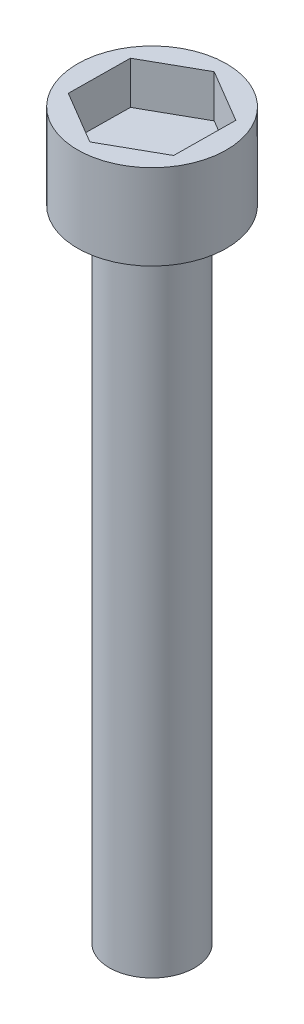
ISO-10303-21;
HEADER;
FILE_DESCRIPTION(('STEP AP214'),'2;1');
FILE_NAME('part.step','',(''),(''),'','','');
FILE_SCHEMA(('AUTOMOTIVE_DESIGN { 1 0 10303 214 1 1 1 1 }'));
ENDSEC;
DATA;
#1=APPLICATION_CONTEXT('core data for automotive mechanical design processes');
#2=APPLICATION_PROTOCOL_DEFINITION('international standard','automotive_design',2000,#1);
#3=PRODUCT_CONTEXT('',#1,'mechanical');
#4=PRODUCT('Part','Part','',(#3));
#5=PRODUCT_RELATED_PRODUCT_CATEGORY('part','',(#4));
#6=PRODUCT_DEFINITION_FORMATION('','',#4);
#7=PRODUCT_DEFINITION_CONTEXT('part definition',#1,'design');
#8=PRODUCT_DEFINITION('design','',#6,#7);
#9=PRODUCT_DEFINITION_SHAPE('','',#8);
#10=(LENGTH_UNIT() NAMED_UNIT(*) SI_UNIT(.MILLI.,.METRE.));
#11=(NAMED_UNIT(*) PLANE_ANGLE_UNIT() SI_UNIT($,.RADIAN.));
#12=(NAMED_UNIT(*) SI_UNIT($,.STERADIAN.) SOLID_ANGLE_UNIT());
#13=UNCERTAINTY_MEASURE_WITH_UNIT(LENGTH_MEASURE(1.E-05),#10,'distance_accuracy_value','');
#14=(GEOMETRIC_REPRESENTATION_CONTEXT(3) GLOBAL_UNCERTAINTY_ASSIGNED_CONTEXT((#13)) GLOBAL_UNIT_ASSIGNED_CONTEXT((#10,
#11,#12)) REPRESENTATION_CONTEXT('',''));
#15=CARTESIAN_POINT('',(0.,0.,0.));
#16=DIRECTION('',(0.,0.,1.));
#17=DIRECTION('',(1.,0.,0.));
#18=AXIS2_PLACEMENT_3D('',#15,#16,#17);
#19=CARTESIAN_POINT('',(0.,-4.,0.));
#20=DIRECTION('',(0.,1.,0.));
#21=DIRECTION('',(0.,0.,-1.));
#22=AXIS2_PLACEMENT_3D('',#19,#20,#21);
#23=CYLINDRICAL_SURFACE('',#22,3.5);
#24=CARTESIAN_POINT('',(0.,-4.,0.));
#25=DIRECTION('',(0.,-1.,0.));
#26=DIRECTION('',(0.,0.,-1.));
#27=AXIS2_PLACEMENT_3D('',#24,#25,#26);
#28=CIRCLE('',#27,3.5);
#29=CARTESIAN_POINT('',(0.,-4.,-3.5));
#30=VERTEX_POINT('',#29);
#31=EDGE_CURVE('E44',#30,#30,#28,.T.);
#32=ORIENTED_EDGE('',*,*,#31,.F.);
#33=EDGE_LOOP('',(#32));
#34=FACE_BOUND('',#33,.T.);
#35=CARTESIAN_POINT('',(0.,0.,0.));
#36=DIRECTION('',(0.,-1.,0.));
#37=DIRECTION('',(0.,0.,-1.));
#38=AXIS2_PLACEMENT_3D('',#35,#36,#37);
#39=CIRCLE('',#38,3.5);
#40=CARTESIAN_POINT('',(0.,0.,-3.5));
#41=VERTEX_POINT('',#40);
#42=EDGE_CURVE('E129',#41,#41,#39,.T.);
#43=ORIENTED_EDGE('',*,*,#42,.T.);
#44=EDGE_LOOP('',(#43));
#45=FACE_BOUND('',#44,.T.);
#46=ADVANCED_FACE('F37',(#34,#45),#23,.T.);
#47=CARTESIAN_POINT('',(0.,-4.,0.));
#48=DIRECTION('',(0.,1.,0.));
#49=DIRECTION('',(0.,0.,-1.));
#50=AXIS2_PLACEMENT_3D('',#47,#48,#49);
#51=PLANE('',#50);
#52=CARTESIAN_POINT('',(0.,-4.,0.));
#53=DIRECTION('',(0.,-1.,0.));
#54=DIRECTION('',(0.,0.,-1.));
#55=AXIS2_PLACEMENT_3D('',#52,#53,#54);
#56=CIRCLE('',#55,2.);
#57=CARTESIAN_POINT('',(0.,-4.,-2.));
#58=VERTEX_POINT('',#57);
#59=EDGE_CURVE('E11',#58,#58,#56,.F.);
#60=ORIENTED_EDGE('',*,*,#59,.T.);
#61=EDGE_LOOP('',(#60));
#62=FACE_BOUND('',#61,.T.);
#63=ORIENTED_EDGE('',*,*,#31,.T.);
#64=EDGE_LOOP('',(#63));
#65=FACE_BOUND('',#64,.T.);
#66=ADVANCED_FACE('F138',(#62,#65),#51,.F.);
#67=CARTESIAN_POINT('',(0.,0.,0.));
#68=DIRECTION('',(0.,1.,0.));
#69=DIRECTION('',(0.,0.,-1.));
#70=AXIS2_PLACEMENT_3D('',#67,#68,#69);
#71=PLANE('',#70);
#72=DIRECTION('',(-0.0108771505972784,0.,0.99994084204761));
#73=VECTOR('',#72,1.);
#74=CARTESIAN_POINT('',(2.51555191968241,0.,-1.41609740933153));
#75=LINE('',#74,#73);
#76=CARTESIAN_POINT('',(2.51555191968241,0.,-1.41609740933153));
#77=VERTEX_POINT('',#76);
#78=CARTESIAN_POINT('',(2.48415229055564,0.,1.47048316231792));
#79=VERTEX_POINT('',#78);
#80=EDGE_CURVE('E251',#77,#79,#75,.T.);
#81=ORIENTED_EDGE('',*,*,#80,.T.);
#82=DIRECTION('',(-0.871412746793473,0.,0.490550532285773));
#83=VECTOR('',#82,1.);
#84=CARTESIAN_POINT('',(2.48415229055564,0.,1.47048316231792));
#85=LINE('',#84,#83);
#86=CARTESIAN_POINT('',(-0.031399629126774,0.,2.88658057164945));
#87=VERTEX_POINT('',#86);
#88=EDGE_CURVE('E246',#79,#87,#85,.T.);
#89=ORIENTED_EDGE('',*,*,#88,.T.);
#90=DIRECTION('',(-0.860535596196194,0.,-0.509390309761837));
#91=VECTOR('',#90,1.);
#92=CARTESIAN_POINT('',(-0.031399629126774,0.,2.88658057164945));
#93=LINE('',#92,#91);
#94=CARTESIAN_POINT('',(-2.51555191968241,0.,1.41609740933153));
#95=VERTEX_POINT('',#94);
#96=EDGE_CURVE('E250',#87,#95,#93,.T.);
#97=ORIENTED_EDGE('',*,*,#96,.T.);
#98=DIRECTION('',(0.0108771505972782,0.,-0.99994084204761));
#99=VECTOR('',#98,1.);
#100=CARTESIAN_POINT('',(-2.51555191968241,0.,1.41609740933153));
#101=LINE('',#100,#99);
#102=CARTESIAN_POINT('',(-2.48415229055564,0.,-1.47048316231792));
#103=VERTEX_POINT('',#102);
#104=EDGE_CURVE('E258',#95,#103,#101,.T.);
#105=ORIENTED_EDGE('',*,*,#104,.T.);
#106=DIRECTION('',(0.871412746793473,0.,-0.490550532285773));
#107=VECTOR('',#106,1.);
#108=CARTESIAN_POINT('',(-2.48415229055564,0.,-1.47048316231792));
#109=LINE('',#108,#107);
#110=CARTESIAN_POINT('',(0.031399629126774,0.,-2.88658057164945));
#111=VERTEX_POINT('',#110);
#112=EDGE_CURVE('E115',#103,#111,#109,.T.);
#113=ORIENTED_EDGE('',*,*,#112,.T.);
#114=DIRECTION('',(0.860535596196194,0.,0.509390309761838));
#115=VECTOR('',#114,1.);
#116=CARTESIAN_POINT('',(0.031399629126774,0.,-2.88658057164945));
#117=LINE('',#116,#115);
#118=EDGE_CURVE('E253',#111,#77,#117,.T.);
#119=ORIENTED_EDGE('',*,*,#118,.T.);
#120=EDGE_LOOP('',(#81,#89,#97,#105,#113,#119));
#121=FACE_BOUND('',#120,.T.);
#122=ORIENTED_EDGE('',*,*,#42,.F.);
#123=EDGE_LOOP('',(#122));
#124=FACE_BOUND('',#123,.T.);
#125=ADVANCED_FACE('F135',(#121,#124),#71,.T.);
#126=CARTESIAN_POINT('',(0.,-34.,0.));
#127=DIRECTION('',(0.,1.,0.));
#128=DIRECTION('',(0.,0.,-1.));
#129=AXIS2_PLACEMENT_3D('',#126,#127,#128);
#130=CYLINDRICAL_SURFACE('',#129,2.);
#131=CARTESIAN_POINT('',(0.,-34.,0.));
#132=DIRECTION('',(0.,1.,0.));
#133=DIRECTION('',(0.,0.,1.));
#134=AXIS2_PLACEMENT_3D('',#131,#132,#133);
#135=CIRCLE('',#134,2.);
#136=CARTESIAN_POINT('',(0.,-34.,2.));
#137=VERTEX_POINT('',#136);
#138=EDGE_CURVE('E126',#137,#137,#135,.T.);
#139=ORIENTED_EDGE('',*,*,#138,.T.);
#140=EDGE_LOOP('',(#139));
#141=FACE_BOUND('',#140,.T.);
#142=ORIENTED_EDGE('',*,*,#59,.F.);
#143=EDGE_LOOP('',(#142));
#144=FACE_BOUND('',#143,.T.);
#145=ADVANCED_FACE('F137',(#141,#144),#130,.T.);
#146=CARTESIAN_POINT('',(0.,-34.,0.));
#147=DIRECTION('',(0.,-1.,0.));
#148=DIRECTION('',(0.,0.,1.));
#149=AXIS2_PLACEMENT_3D('',#146,#147,#148);
#150=PLANE('',#149);
#151=ORIENTED_EDGE('',*,*,#138,.F.);
#152=EDGE_LOOP('',(#151));
#153=FACE_BOUND('',#152,.T.);
#154=ADVANCED_FACE('F144',(#153),#150,.T.);
#155=CARTESIAN_POINT('',(2.51555191968241,-2.,-1.41609740933153));
#156=DIRECTION('',(0.99994084204761,0.,0.0108771505972784));
#157=DIRECTION('',(-0.0108771505972784,0.,0.999940842047611));
#158=AXIS2_PLACEMENT_3D('',#155,#156,#157);
#159=PLANE('',#158);
#160=ORIENTED_EDGE('',*,*,#80,.F.);
#161=DIRECTION('',(0.,1.,0.));
#162=VECTOR('',#161,1.);
#163=CARTESIAN_POINT('',(2.51555191968241,-2.,-1.41609740933153));
#164=LINE('',#163,#162);
#165=CARTESIAN_POINT('',(2.51555191968241,-2.,-1.41609740933153));
#166=VERTEX_POINT('',#165);
#167=EDGE_CURVE('E82',#166,#77,#164,.T.);
#168=ORIENTED_EDGE('',*,*,#167,.F.);
#169=DIRECTION('',(-0.0108771505972784,0.,0.99994084204761));
#170=VECTOR('',#169,1.);
#171=CARTESIAN_POINT('',(2.51555191968241,-2.,-1.41609740933153));
#172=LINE('',#171,#170);
#173=CARTESIAN_POINT('',(2.48415229055564,-2.,1.47048316231792));
#174=VERTEX_POINT('',#173);
#175=EDGE_CURVE('E261',#166,#174,#172,.T.);
#176=ORIENTED_EDGE('',*,*,#175,.T.);
#177=DIRECTION('',(0.,1.,0.));
#178=VECTOR('',#177,1.);
#179=CARTESIAN_POINT('',(2.48415229055564,-2.,1.47048316231792));
#180=LINE('',#179,#178);
#181=EDGE_CURVE('E51',#174,#79,#180,.T.);
#182=ORIENTED_EDGE('',*,*,#181,.T.);
#183=EDGE_LOOP('',(#160,#168,#176,#182));
#184=FACE_BOUND('',#183,.T.);
#185=ADVANCED_FACE('F179',(#184),#159,.F.);
#186=CARTESIAN_POINT('',(0.031399629126774,-2.,-2.88658057164945));
#187=DIRECTION('',(0.509390309761838,0.,-0.860535596196194));
#188=DIRECTION('',(0.860535596196194,0.,0.509390309761838));
#189=AXIS2_PLACEMENT_3D('',#186,#187,#188);
#190=PLANE('',#189);
#191=ORIENTED_EDGE('',*,*,#118,.F.);
#192=DIRECTION('',(0.,1.,0.));
#193=VECTOR('',#192,1.);
#194=CARTESIAN_POINT('',(0.031399629126774,-2.,-2.88658057164945));
#195=LINE('',#194,#193);
#196=CARTESIAN_POINT('',(0.031399629126774,-2.,-2.88658057164945));
#197=VERTEX_POINT('',#196);
#198=EDGE_CURVE('E117',#197,#111,#195,.T.);
#199=ORIENTED_EDGE('',*,*,#198,.F.);
#200=DIRECTION('',(0.860535596196194,0.,0.509390309761838));
#201=VECTOR('',#200,1.);
#202=CARTESIAN_POINT('',(0.031399629126774,-2.,-2.88658057164945));
#203=LINE('',#202,#201);
#204=EDGE_CURVE('E60',#197,#166,#203,.T.);
#205=ORIENTED_EDGE('',*,*,#204,.T.);
#206=ORIENTED_EDGE('',*,*,#167,.T.);
#207=EDGE_LOOP('',(#191,#199,#205,#206));
#208=FACE_BOUND('',#207,.T.);
#209=ADVANCED_FACE('F189',(#208),#190,.F.);
#210=CARTESIAN_POINT('',(-2.48415229055564,-2.,-1.47048316231792));
#211=DIRECTION('',(-0.490550532285773,0.,-0.871412746793473));
#212=DIRECTION('',(0.871412746793473,0.,-0.490550532285773));
#213=AXIS2_PLACEMENT_3D('',#210,#211,#212);
#214=PLANE('',#213);
#215=ORIENTED_EDGE('',*,*,#112,.F.);
#216=DIRECTION('',(0.,1.,0.));
#217=VECTOR('',#216,1.);
#218=CARTESIAN_POINT('',(-2.48415229055564,-2.,-1.47048316231792));
#219=LINE('',#218,#217);
#220=CARTESIAN_POINT('',(-2.48415229055564,-2.,-1.47048316231792));
#221=VERTEX_POINT('',#220);
#222=EDGE_CURVE('E104',#221,#103,#219,.T.);
#223=ORIENTED_EDGE('',*,*,#222,.F.);
#224=DIRECTION('',(0.871412746793473,0.,-0.490550532285773));
#225=VECTOR('',#224,1.);
#226=CARTESIAN_POINT('',(-2.48415229055564,-2.,-1.47048316231792));
#227=LINE('',#226,#225);
#228=EDGE_CURVE('E107',#221,#197,#227,.T.);
#229=ORIENTED_EDGE('',*,*,#228,.T.);
#230=ORIENTED_EDGE('',*,*,#198,.T.);
#231=EDGE_LOOP('',(#215,#223,#229,#230));
#232=FACE_BOUND('',#231,.T.);
#233=ADVANCED_FACE('F113',(#232),#214,.F.);
#234=CARTESIAN_POINT('',(-2.51555191968241,-2.,1.41609740933153));
#235=DIRECTION('',(-0.99994084204761,0.,-0.0108771505972782));
#236=DIRECTION('',(0.0108771505972782,0.,-0.999940842047611));
#237=AXIS2_PLACEMENT_3D('',#234,#235,#236);
#238=PLANE('',#237);
#239=ORIENTED_EDGE('',*,*,#104,.F.);
#240=DIRECTION('',(0.,1.,0.));
#241=VECTOR('',#240,1.);
#242=CARTESIAN_POINT('',(-2.51555191968241,-2.,1.41609740933153));
#243=LINE('',#242,#241);
#244=CARTESIAN_POINT('',(-2.51555191968241,-2.,1.41609740933153));
#245=VERTEX_POINT('',#244);
#246=EDGE_CURVE('E106',#245,#95,#243,.T.);
#247=ORIENTED_EDGE('',*,*,#246,.F.);
#248=DIRECTION('',(0.0108771505972782,0.,-0.99994084204761));
#249=VECTOR('',#248,1.);
#250=CARTESIAN_POINT('',(-2.51555191968241,-2.,1.41609740933153));
#251=LINE('',#250,#249);
#252=EDGE_CURVE('E99',#245,#221,#251,.T.);
#253=ORIENTED_EDGE('',*,*,#252,.T.);
#254=ORIENTED_EDGE('',*,*,#222,.T.);
#255=EDGE_LOOP('',(#239,#247,#253,#254));
#256=FACE_BOUND('',#255,.T.);
#257=ADVANCED_FACE('F102',(#256),#238,.F.);
#258=CARTESIAN_POINT('',(-0.031399629126774,-2.,2.88658057164945));
#259=DIRECTION('',(-0.509390309761837,0.,0.860535596196194));
#260=DIRECTION('',(-0.860535596196194,0.,-0.509390309761837));
#261=AXIS2_PLACEMENT_3D('',#258,#259,#260);
#262=PLANE('',#261);
#263=ORIENTED_EDGE('',*,*,#96,.F.);
#264=DIRECTION('',(0.,1.,0.));
#265=VECTOR('',#264,1.);
#266=CARTESIAN_POINT('',(-0.031399629126774,-2.,2.88658057164945));
#267=LINE('',#266,#265);
#268=CARTESIAN_POINT('',(-0.031399629126774,-2.,2.88658057164945));
#269=VERTEX_POINT('',#268);
#270=EDGE_CURVE('E120',#269,#87,#267,.T.);
#271=ORIENTED_EDGE('',*,*,#270,.F.);
#272=DIRECTION('',(-0.860535596196194,0.,-0.509390309761837));
#273=VECTOR('',#272,1.);
#274=CARTESIAN_POINT('',(-0.031399629126774,-2.,2.88658057164945));
#275=LINE('',#274,#273);
#276=EDGE_CURVE('E108',#269,#245,#275,.T.);
#277=ORIENTED_EDGE('',*,*,#276,.T.);
#278=ORIENTED_EDGE('',*,*,#246,.T.);
#279=EDGE_LOOP('',(#263,#271,#277,#278));
#280=FACE_BOUND('',#279,.T.);
#281=ADVANCED_FACE('F216',(#280),#262,.F.);
#282=CARTESIAN_POINT('',(2.48415229055564,-2.,1.47048316231792));
#283=DIRECTION('',(0.490550532285773,0.,0.871412746793473));
#284=DIRECTION('',(-0.871412746793473,0.,0.490550532285773));
#285=AXIS2_PLACEMENT_3D('',#282,#283,#284);
#286=PLANE('',#285);
#287=ORIENTED_EDGE('',*,*,#88,.F.);
#288=ORIENTED_EDGE('',*,*,#181,.F.);
#289=DIRECTION('',(-0.871412746793473,0.,0.490550532285773));
#290=VECTOR('',#289,1.);
#291=CARTESIAN_POINT('',(2.48415229055564,-2.,1.47048316231792));
#292=LINE('',#291,#290);
#293=EDGE_CURVE('E90',#174,#269,#292,.T.);
#294=ORIENTED_EDGE('',*,*,#293,.T.);
#295=ORIENTED_EDGE('',*,*,#270,.T.);
#296=EDGE_LOOP('',(#287,#288,#294,#295));
#297=FACE_BOUND('',#296,.T.);
#298=ADVANCED_FACE('F225',(#297),#286,.F.);
#299=CARTESIAN_POINT('',(0.,-2.,0.));
#300=DIRECTION('',(0.,1.,0.));
#301=DIRECTION('',(0.,0.,-1.));
#302=AXIS2_PLACEMENT_3D('',#299,#300,#301);
#303=PLANE('',#302);
#304=ORIENTED_EDGE('',*,*,#175,.F.);
#305=ORIENTED_EDGE('',*,*,#204,.F.);
#306=ORIENTED_EDGE('',*,*,#228,.F.);
#307=ORIENTED_EDGE('',*,*,#252,.F.);
#308=ORIENTED_EDGE('',*,*,#276,.F.);
#309=ORIENTED_EDGE('',*,*,#293,.F.);
#310=EDGE_LOOP('',(#304,#305,#306,#307,#308,#309));
#311=FACE_BOUND('',#310,.T.);
#312=ADVANCED_FACE('F110',(#311),#303,.T.);
#313=CLOSED_SHELL('',(#46,#66,#125,#145,#154,#185,#209,#233,#257,#281,#298,#312));
#314=MANIFOLD_SOLID_BREP('B2',#313);
#315=ADVANCED_BREP_SHAPE_REPRESENTATION('',(#18,#314),#14);
#316=SHAPE_DEFINITION_REPRESENTATION(#9,#315);
ENDSEC;
END-ISO-10303-21;
